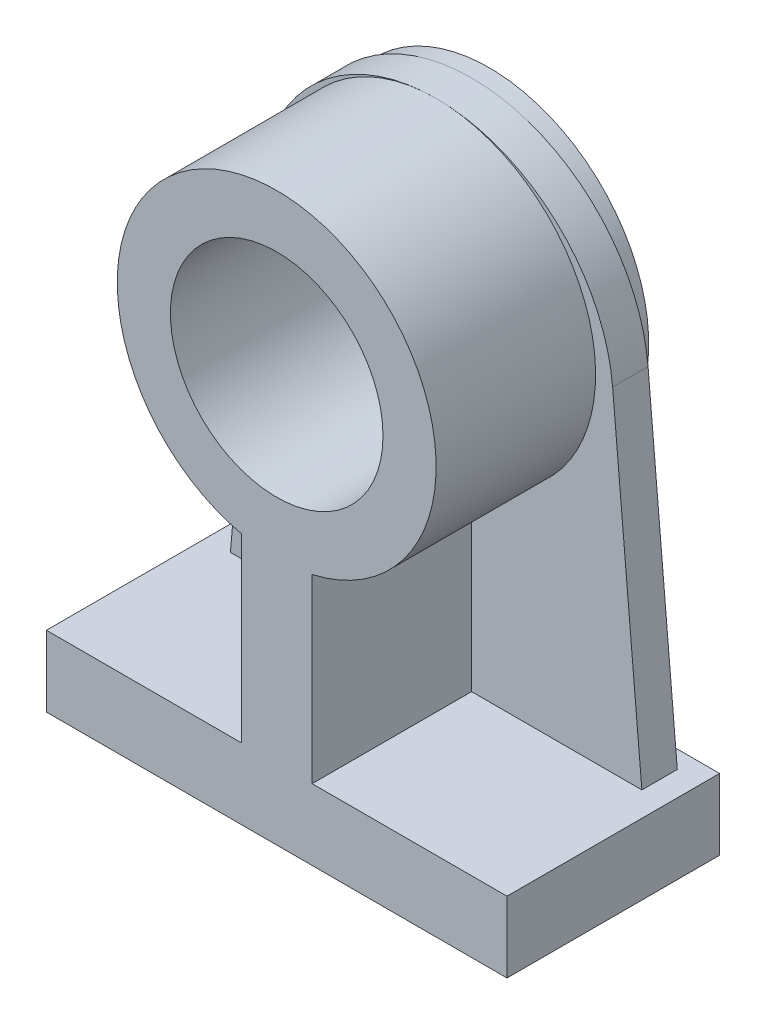
ISO-10303-21;
HEADER;
FILE_DESCRIPTION(('STEP AP214'),'2;1');
FILE_NAME('part.step','',(''),(''),'','','');
FILE_SCHEMA(('AUTOMOTIVE_DESIGN { 1 0 10303 214 1 1 1 1 }'));
ENDSEC;
DATA;
#1=APPLICATION_CONTEXT('core data for automotive mechanical design processes');
#2=APPLICATION_PROTOCOL_DEFINITION('international standard','automotive_design',2000,#1);
#3=PRODUCT_CONTEXT('',#1,'mechanical');
#4=PRODUCT('Part','Part','',(#3));
#5=PRODUCT_RELATED_PRODUCT_CATEGORY('part','',(#4));
#6=PRODUCT_DEFINITION_FORMATION('','',#4);
#7=PRODUCT_DEFINITION_CONTEXT('part definition',#1,'design');
#8=PRODUCT_DEFINITION('design','',#6,#7);
#9=PRODUCT_DEFINITION_SHAPE('','',#8);
#10=(LENGTH_UNIT() NAMED_UNIT(*) SI_UNIT(.MILLI.,.METRE.));
#11=(NAMED_UNIT(*) PLANE_ANGLE_UNIT() SI_UNIT($,.RADIAN.));
#12=(NAMED_UNIT(*) SI_UNIT($,.STERADIAN.) SOLID_ANGLE_UNIT());
#13=UNCERTAINTY_MEASURE_WITH_UNIT(LENGTH_MEASURE(1.E-05),#10,'distance_accuracy_value','');
#14=(GEOMETRIC_REPRESENTATION_CONTEXT(3) GLOBAL_UNCERTAINTY_ASSIGNED_CONTEXT((#13)) GLOBAL_UNIT_ASSIGNED_CONTEXT((#10,
#11,#12)) REPRESENTATION_CONTEXT('',''));
#15=CARTESIAN_POINT('',(0.,0.,0.));
#16=DIRECTION('',(0.,0.,1.));
#17=DIRECTION('',(1.,0.,0.));
#18=AXIS2_PLACEMENT_3D('',#15,#16,#17);
#19=CARTESIAN_POINT('',(0.,0.,2.5));
#20=DIRECTION('',(0.,0.,1.));
#21=DIRECTION('',(1.,0.,0.));
#22=AXIS2_PLACEMENT_3D('',#19,#20,#21);
#23=PLANE('',#22);
#24=DIRECTION('',(0.,-1.,0.));
#25=VECTOR('',#24,1.);
#26=CARTESIAN_POINT('',(4.99999999999999,0.,2.5));
#27=LINE('',#26,#25);
#28=CARTESIAN_POINT('',(5.,30.5625890315197,2.5));
#29=VERTEX_POINT('',#28);
#30=CARTESIAN_POINT('',(4.99999999999999,5.,2.5));
#31=VERTEX_POINT('',#30);
#32=EDGE_CURVE('E50',#29,#31,#27,.T.);
#33=ORIENTED_EDGE('',*,*,#32,.T.);
#34=DIRECTION('',(1.,0.,0.));
#35=VECTOR('',#34,1.);
#36=CARTESIAN_POINT('',(0.,5.,2.5));
#37=LINE('',#36,#35);
#38=CARTESIAN_POINT('',(29.0324857972501,5.,2.5));
#39=VERTEX_POINT('',#38);
#40=EDGE_CURVE('E242',#31,#39,#37,.T.);
#41=ORIENTED_EDGE('',*,*,#40,.T.);
#42=DIRECTION('',(-0.0871557427476544,0.996194698091746,0.));
#43=VECTOR('',#42,1.);
#44=CARTESIAN_POINT('',(29.2460718939667,2.55869974338613,2.5));
#45=LINE('',#44,#43);
#46=CARTESIAN_POINT('',(24.9048674522936,52.1788935686914,2.5));
#47=VERTEX_POINT('',#46);
#48=EDGE_CURVE('E253',#39,#47,#45,.T.);
#49=ORIENTED_EDGE('',*,*,#48,.T.);
#50=CARTESIAN_POINT('',(0.,50.,2.5));
#51=DIRECTION('',(0.,0.,1.));
#52=DIRECTION('',(1.,0.,0.));
#53=AXIS2_PLACEMENT_3D('',#50,#51,#52);
#54=CIRCLE('',#53,25.);
#55=CARTESIAN_POINT('',(0.,75.,2.5));
#56=VERTEX_POINT('',#55);
#57=EDGE_CURVE('E250',#56,#47,#54,.F.);
#58=ORIENTED_EDGE('',*,*,#57,.F.);
#59=CARTESIAN_POINT('',(0.,52.5,2.5));
#60=DIRECTION('',(0.,0.,1.));
#61=DIRECTION('',(1.,0.,0.));
#62=AXIS2_PLACEMENT_3D('',#59,#60,#61);
#63=CIRCLE('',#62,22.5);
#64=EDGE_CURVE('E238',#29,#56,#63,.T.);
#65=ORIENTED_EDGE('',*,*,#64,.F.);
#66=EDGE_LOOP('',(#33,#41,#49,#58,#65));
#67=FACE_BOUND('',#66,.T.);
#68=ADVANCED_FACE('F35',(#67),#23,.T.);
#69=DIRECTION('',(0.0871557427476544,0.996194698091746,0.));
#70=VECTOR('',#69,1.);
#71=CARTESIAN_POINT('',(-29.2460718939667,2.55869974338613,2.5));
#72=LINE('',#71,#70);
#73=CARTESIAN_POINT('',(-29.0324857972501,5.,2.5));
#74=VERTEX_POINT('',#73);
#75=CARTESIAN_POINT('',(-24.9048674522936,52.1788935686914,2.5));
#76=VERTEX_POINT('',#75);
#77=EDGE_CURVE('E249',#74,#76,#72,.T.);
#78=ORIENTED_EDGE('',*,*,#77,.F.);
#79=DIRECTION('',(1.,0.,0.));
#80=VECTOR('',#79,1.);
#81=CARTESIAN_POINT('',(0.,5.,2.5));
#82=LINE('',#81,#80);
#83=CARTESIAN_POINT('',(-4.99999999999999,5.,2.5));
#84=VERTEX_POINT('',#83);
#85=EDGE_CURVE('E58',#74,#84,#82,.T.);
#86=ORIENTED_EDGE('',*,*,#85,.T.);
#87=DIRECTION('',(0.,-1.,0.));
#88=VECTOR('',#87,1.);
#89=CARTESIAN_POINT('',(-4.99999999999999,0.,2.5));
#90=LINE('',#89,#88);
#91=CARTESIAN_POINT('',(-5.,30.5625890315197,2.5));
#92=VERTEX_POINT('',#91);
#93=EDGE_CURVE('E239',#92,#84,#90,.T.);
#94=ORIENTED_EDGE('',*,*,#93,.F.);
#95=EDGE_CURVE('E228',#56,#92,#63,.T.);
#96=ORIENTED_EDGE('',*,*,#95,.F.);
#97=EDGE_CURVE('E246',#76,#56,#54,.F.);
#98=ORIENTED_EDGE('',*,*,#97,.F.);
#99=EDGE_LOOP('',(#78,#86,#94,#96,#98));
#100=FACE_BOUND('',#99,.T.);
#101=ADVANCED_FACE('F344',(#100),#23,.T.);
#102=CARTESIAN_POINT('',(0.,0.,-2.5));
#103=DIRECTION('',(0.,0.,1.));
#104=DIRECTION('',(1.,0.,0.));
#105=AXIS2_PLACEMENT_3D('',#102,#103,#104);
#106=PLANE('',#105);
#107=DIRECTION('',(1.,0.,0.));
#108=VECTOR('',#107,1.);
#109=CARTESIAN_POINT('',(0.,5.,-2.5));
#110=LINE('',#109,#108);
#111=CARTESIAN_POINT('',(4.99999999999999,5.,-2.5));
#112=VERTEX_POINT('',#111);
#113=CARTESIAN_POINT('',(29.0324857972501,5.,-2.5));
#114=VERTEX_POINT('',#113);
#115=EDGE_CURVE('E11',#112,#114,#110,.T.);
#116=ORIENTED_EDGE('',*,*,#115,.F.);
#117=DIRECTION('',(0.,-1.,0.));
#118=VECTOR('',#117,1.);
#119=CARTESIAN_POINT('',(4.99999999999999,0.,-2.5));
#120=LINE('',#119,#118);
#121=CARTESIAN_POINT('',(5.,30.5625890315197,-2.5));
#122=VERTEX_POINT('',#121);
#123=EDGE_CURVE('E43',#122,#112,#120,.T.);
#124=ORIENTED_EDGE('',*,*,#123,.F.);
#125=CARTESIAN_POINT('',(0.,52.5,-2.5));
#126=DIRECTION('',(0.,0.,1.));
#127=DIRECTION('',(1.,0.,0.));
#128=AXIS2_PLACEMENT_3D('',#125,#126,#127);
#129=CIRCLE('',#128,22.5);
#130=CARTESIAN_POINT('',(0.,75.,-2.5));
#131=VERTEX_POINT('',#130);
#132=EDGE_CURVE('E287',#122,#131,#129,.T.);
#133=ORIENTED_EDGE('',*,*,#132,.T.);
#134=CARTESIAN_POINT('',(0.,50.,-2.5));
#135=DIRECTION('',(0.,0.,1.));
#136=DIRECTION('',(1.,0.,0.));
#137=AXIS2_PLACEMENT_3D('',#134,#135,#136);
#138=CIRCLE('',#137,25.);
#139=CARTESIAN_POINT('',(24.9048674522936,52.1788935686914,-2.5));
#140=VERTEX_POINT('',#139);
#141=EDGE_CURVE('E245',#131,#140,#138,.F.);
#142=ORIENTED_EDGE('',*,*,#141,.T.);
#143=DIRECTION('',(-0.0871557427476544,0.996194698091746,0.));
#144=VECTOR('',#143,1.);
#145=CARTESIAN_POINT('',(29.2460718939667,2.55869974338613,-2.5));
#146=LINE('',#145,#144);
#147=EDGE_CURVE('E263',#114,#140,#146,.T.);
#148=ORIENTED_EDGE('',*,*,#147,.F.);
#149=EDGE_LOOP('',(#116,#124,#133,#142,#148));
#150=FACE_BOUND('',#149,.T.);
#151=ADVANCED_FACE('F304',(#150),#106,.F.);
#152=DIRECTION('',(1.,0.,0.));
#153=VECTOR('',#152,1.);
#154=CARTESIAN_POINT('',(0.,5.,-2.5));
#155=LINE('',#154,#153);
#156=CARTESIAN_POINT('',(-29.0324857972501,5.,-2.5));
#157=VERTEX_POINT('',#156);
#158=CARTESIAN_POINT('',(-4.99999999999999,5.,-2.5));
#159=VERTEX_POINT('',#158);
#160=EDGE_CURVE('E291',#157,#159,#155,.T.);
#161=ORIENTED_EDGE('',*,*,#160,.F.);
#162=DIRECTION('',(0.0871557427476544,0.996194698091746,0.));
#163=VECTOR('',#162,1.);
#164=CARTESIAN_POINT('',(-29.2460718939667,2.55869974338613,-2.5));
#165=LINE('',#164,#163);
#166=CARTESIAN_POINT('',(-24.9048674522936,52.1788935686914,-2.5));
#167=VERTEX_POINT('',#166);
#168=EDGE_CURVE('E260',#157,#167,#165,.T.);
#169=ORIENTED_EDGE('',*,*,#168,.T.);
#170=EDGE_CURVE('E257',#167,#131,#138,.F.);
#171=ORIENTED_EDGE('',*,*,#170,.T.);
#172=CARTESIAN_POINT('',(-5.,30.5625890315197,-2.5));
#173=VERTEX_POINT('',#172);
#174=EDGE_CURVE('E284',#131,#173,#129,.T.);
#175=ORIENTED_EDGE('',*,*,#174,.T.);
#176=DIRECTION('',(0.,-1.,0.));
#177=VECTOR('',#176,1.);
#178=CARTESIAN_POINT('',(-4.99999999999999,0.,-2.5));
#179=LINE('',#178,#177);
#180=EDGE_CURVE('E288',#173,#159,#179,.T.);
#181=ORIENTED_EDGE('',*,*,#180,.T.);
#182=EDGE_LOOP('',(#161,#169,#171,#175,#181));
#183=FACE_BOUND('',#182,.T.);
#184=ADVANCED_FACE('F340',(#183),#106,.F.);
#185=CARTESIAN_POINT('',(0.,50.,2.5));
#186=DIRECTION('',(0.,0.,-1.));
#187=DIRECTION('',(-1.,0.,0.));
#188=AXIS2_PLACEMENT_3D('',#185,#186,#187);
#189=CYLINDRICAL_SURFACE('',#188,25.);
#190=ORIENTED_EDGE('',*,*,#97,.T.);
#191=ORIENTED_EDGE('',*,*,#57,.T.);
#192=DIRECTION('',(0.,0.,-1.));
#193=VECTOR('',#192,1.);
#194=CARTESIAN_POINT('',(24.9048674522936,52.1788935686914,2.5));
#195=LINE('',#194,#193);
#196=EDGE_CURVE('E256',#47,#140,#195,.T.);
#197=ORIENTED_EDGE('',*,*,#196,.T.);
#198=ORIENTED_EDGE('',*,*,#141,.F.);
#199=ORIENTED_EDGE('',*,*,#170,.F.);
#200=DIRECTION('',(0.,0.,-1.));
#201=VECTOR('',#200,1.);
#202=CARTESIAN_POINT('',(-24.9048674522936,52.1788935686914,2.5));
#203=LINE('',#202,#201);
#204=EDGE_CURVE('E282',#76,#167,#203,.T.);
#205=ORIENTED_EDGE('',*,*,#204,.F.);
#206=EDGE_LOOP('',(#190,#191,#197,#198,#199,#205));
#207=FACE_BOUND('',#206,.T.);
#208=ADVANCED_FACE('F37',(#207),#189,.T.);
#209=CARTESIAN_POINT('',(-29.2460718939667,2.55869974338613,2.5));
#210=DIRECTION('',(-0.996194698091746,0.0871557427476544,0.));
#211=DIRECTION('',(-0.0871557427476544,-0.996194698091746,0.));
#212=AXIS2_PLACEMENT_3D('',#209,#210,#211);
#213=PLANE('',#212);
#214=ORIENTED_EDGE('',*,*,#168,.F.);
#215=DIRECTION('',(0.,0.,-1.));
#216=VECTOR('',#215,1.);
#217=CARTESIAN_POINT('',(-29.0324857972501,5.,2.5));
#218=LINE('',#217,#216);
#219=EDGE_CURVE('E279',#74,#157,#218,.T.);
#220=ORIENTED_EDGE('',*,*,#219,.F.);
#221=ORIENTED_EDGE('',*,*,#77,.T.);
#222=ORIENTED_EDGE('',*,*,#204,.T.);
#223=EDGE_LOOP('',(#214,#220,#221,#222));
#224=FACE_BOUND('',#223,.T.);
#225=ADVANCED_FACE('F343',(#224),#213,.T.);
#226=CARTESIAN_POINT('',(0.,5.,2.5));
#227=DIRECTION('',(0.,1.,0.));
#228=DIRECTION('',(-1.,0.,0.));
#229=AXIS2_PLACEMENT_3D('',#226,#227,#228);
#230=PLANE('',#229);
#231=ORIENTED_EDGE('',*,*,#219,.T.);
#232=ORIENTED_EDGE('',*,*,#160,.T.);
#233=DIRECTION('',(0.,0.,1.));
#234=VECTOR('',#233,1.);
#235=CARTESIAN_POINT('',(-4.99999999999999,5.,-5.));
#236=LINE('',#235,#234);
#237=CARTESIAN_POINT('',(-4.99999999999999,5.,-5.));
#238=VERTEX_POINT('',#237);
#239=EDGE_CURVE('E230',#238,#159,#236,.T.);
#240=ORIENTED_EDGE('',*,*,#239,.F.);
#241=DIRECTION('',(1.,0.,0.));
#242=VECTOR('',#241,1.);
#243=CARTESIAN_POINT('',(0.,5.,-5.));
#244=LINE('',#243,#242);
#245=CARTESIAN_POINT('',(-32.5,5.,-5.));
#246=VERTEX_POINT('',#245);
#247=EDGE_CURVE('E212',#246,#238,#244,.T.);
#248=ORIENTED_EDGE('',*,*,#247,.F.);
#249=DIRECTION('',(0.,0.,-1.));
#250=VECTOR('',#249,1.);
#251=CARTESIAN_POINT('',(-32.5,5.,2.5));
#252=LINE('',#251,#250);
#253=CARTESIAN_POINT('',(-32.5,5.,25.));
#254=VERTEX_POINT('',#253);
#255=EDGE_CURVE('E277',#254,#246,#252,.T.);
#256=ORIENTED_EDGE('',*,*,#255,.F.);
#257=DIRECTION('',(1.,0.,0.));
#258=VECTOR('',#257,1.);
#259=CARTESIAN_POINT('',(0.,5.,25.));
#260=LINE('',#259,#258);
#261=CARTESIAN_POINT('',(-4.99999999999999,5.,25.));
#262=VERTEX_POINT('',#261);
#263=EDGE_CURVE('E187',#254,#262,#260,.T.);
#264=ORIENTED_EDGE('',*,*,#263,.T.);
#265=EDGE_CURVE('E233',#84,#262,#236,.T.);
#266=ORIENTED_EDGE('',*,*,#265,.F.);
#267=ORIENTED_EDGE('',*,*,#85,.F.);
#268=EDGE_LOOP('',(#231,#232,#240,#248,#256,#264,#266,#267));
#269=FACE_BOUND('',#268,.T.);
#270=ADVANCED_FACE('F319',(#269),#230,.T.);
#271=CARTESIAN_POINT('',(-32.5,0.,2.5));
#272=DIRECTION('',(1.,0.,0.));
#273=DIRECTION('',(0.,0.,-1.));
#274=AXIS2_PLACEMENT_3D('',#271,#272,#273);
#275=PLANE('',#274);
#276=ORIENTED_EDGE('',*,*,#255,.T.);
#277=DIRECTION('',(0.,-1.,0.));
#278=VECTOR('',#277,1.);
#279=CARTESIAN_POINT('',(-32.5,0.,-5.));
#280=LINE('',#279,#278);
#281=CARTESIAN_POINT('',(-32.5,-5.,-5.));
#282=VERTEX_POINT('',#281);
#283=EDGE_CURVE('E214',#246,#282,#280,.T.);
#284=ORIENTED_EDGE('',*,*,#283,.T.);
#285=DIRECTION('',(0.,0.,-1.));
#286=VECTOR('',#285,1.);
#287=CARTESIAN_POINT('',(-32.5,-5.,2.5));
#288=LINE('',#287,#286);
#289=CARTESIAN_POINT('',(-32.5,-5.,25.));
#290=VERTEX_POINT('',#289);
#291=EDGE_CURVE('E275',#290,#282,#288,.T.);
#292=ORIENTED_EDGE('',*,*,#291,.F.);
#293=DIRECTION('',(0.,-1.,0.));
#294=VECTOR('',#293,1.);
#295=CARTESIAN_POINT('',(-32.5,0.,25.));
#296=LINE('',#295,#294);
#297=EDGE_CURVE('E190',#254,#290,#296,.T.);
#298=ORIENTED_EDGE('',*,*,#297,.F.);
#299=EDGE_LOOP('',(#276,#284,#292,#298));
#300=FACE_BOUND('',#299,.T.);
#301=ADVANCED_FACE('F325',(#300),#275,.F.);
#302=CARTESIAN_POINT('',(0.,-5.,2.5));
#303=DIRECTION('',(0.,1.,0.));
#304=DIRECTION('',(0.,0.,1.));
#305=AXIS2_PLACEMENT_3D('',#302,#303,#304);
#306=PLANE('',#305);
#307=ORIENTED_EDGE('',*,*,#291,.T.);
#308=DIRECTION('',(1.,0.,0.));
#309=VECTOR('',#308,1.);
#310=CARTESIAN_POINT('',(0.,-5.,-5.));
#311=LINE('',#310,#309);
#312=CARTESIAN_POINT('',(32.5,-5.,-5.));
#313=VERTEX_POINT('',#312);
#314=EDGE_CURVE('E217',#282,#313,#311,.T.);
#315=ORIENTED_EDGE('',*,*,#314,.T.);
#316=DIRECTION('',(0.,0.,-1.));
#317=VECTOR('',#316,1.);
#318=CARTESIAN_POINT('',(32.5,-5.,2.5));
#319=LINE('',#318,#317);
#320=CARTESIAN_POINT('',(32.5,-5.,25.));
#321=VERTEX_POINT('',#320);
#322=EDGE_CURVE('E273',#321,#313,#319,.T.);
#323=ORIENTED_EDGE('',*,*,#322,.F.);
#324=DIRECTION('',(1.,0.,0.));
#325=VECTOR('',#324,1.);
#326=CARTESIAN_POINT('',(0.,-5.,25.));
#327=LINE('',#326,#325);
#328=EDGE_CURVE('E193',#290,#321,#327,.T.);
#329=ORIENTED_EDGE('',*,*,#328,.F.);
#330=EDGE_LOOP('',(#307,#315,#323,#329));
#331=FACE_BOUND('',#330,.T.);
#332=ADVANCED_FACE('F375',(#331),#306,.F.);
#333=CARTESIAN_POINT('',(32.5,0.,2.5));
#334=DIRECTION('',(1.,0.,0.));
#335=DIRECTION('',(0.,0.,-1.));
#336=AXIS2_PLACEMENT_3D('',#333,#334,#335);
#337=PLANE('',#336);
#338=ORIENTED_EDGE('',*,*,#322,.T.);
#339=DIRECTION('',(0.,-1.,0.));
#340=VECTOR('',#339,1.);
#341=CARTESIAN_POINT('',(32.5,0.,-5.));
#342=LINE('',#341,#340);
#343=CARTESIAN_POINT('',(32.5,5.,-5.));
#344=VERTEX_POINT('',#343);
#345=EDGE_CURVE('E220',#344,#313,#342,.T.);
#346=ORIENTED_EDGE('',*,*,#345,.F.);
#347=DIRECTION('',(0.,0.,-1.));
#348=VECTOR('',#347,1.);
#349=CARTESIAN_POINT('',(32.5,5.,2.5));
#350=LINE('',#349,#348);
#351=CARTESIAN_POINT('',(32.5,5.,25.));
#352=VERTEX_POINT('',#351);
#353=EDGE_CURVE('E271',#352,#344,#350,.T.);
#354=ORIENTED_EDGE('',*,*,#353,.F.);
#355=DIRECTION('',(0.,-1.,0.));
#356=VECTOR('',#355,1.);
#357=CARTESIAN_POINT('',(32.5,0.,25.));
#358=LINE('',#357,#356);
#359=EDGE_CURVE('E196',#352,#321,#358,.T.);
#360=ORIENTED_EDGE('',*,*,#359,.T.);
#361=EDGE_LOOP('',(#338,#346,#354,#360));
#362=FACE_BOUND('',#361,.T.);
#363=ADVANCED_FACE('F329',(#362),#337,.T.);
#364=CARTESIAN_POINT('',(0.,5.,2.5));
#365=DIRECTION('',(0.,1.,0.));
#366=DIRECTION('',(-1.,0.,0.));
#367=AXIS2_PLACEMENT_3D('',#364,#365,#366);
#368=PLANE('',#367);
#369=ORIENTED_EDGE('',*,*,#353,.T.);
#370=DIRECTION('',(1.,0.,0.));
#371=VECTOR('',#370,1.);
#372=CARTESIAN_POINT('',(0.,5.,-5.));
#373=LINE('',#372,#371);
#374=CARTESIAN_POINT('',(4.99999999999999,5.,-5.));
#375=VERTEX_POINT('',#374);
#376=EDGE_CURVE('E164',#375,#344,#373,.T.);
#377=ORIENTED_EDGE('',*,*,#376,.F.);
#378=DIRECTION('',(0.,0.,1.));
#379=VECTOR('',#378,1.);
#380=CARTESIAN_POINT('',(4.99999999999999,5.,-5.));
#381=LINE('',#380,#379);
#382=EDGE_CURVE('E225',#375,#112,#381,.T.);
#383=ORIENTED_EDGE('',*,*,#382,.T.);
#384=ORIENTED_EDGE('',*,*,#115,.T.);
#385=DIRECTION('',(0.,0.,-1.));
#386=VECTOR('',#385,1.);
#387=CARTESIAN_POINT('',(29.0324857972501,5.,2.5));
#388=LINE('',#387,#386);
#389=EDGE_CURVE('E268',#39,#114,#388,.T.);
#390=ORIENTED_EDGE('',*,*,#389,.F.);
#391=ORIENTED_EDGE('',*,*,#40,.F.);
#392=CARTESIAN_POINT('',(4.99999999999999,5.,25.));
#393=VERTEX_POINT('',#392);
#394=EDGE_CURVE('E229',#31,#393,#381,.T.);
#395=ORIENTED_EDGE('',*,*,#394,.T.);
#396=DIRECTION('',(1.,0.,0.));
#397=VECTOR('',#396,1.);
#398=CARTESIAN_POINT('',(0.,5.,25.));
#399=LINE('',#398,#397);
#400=EDGE_CURVE('E180',#393,#352,#399,.T.);
#401=ORIENTED_EDGE('',*,*,#400,.T.);
#402=EDGE_LOOP('',(#369,#377,#383,#384,#390,#391,#395,#401));
#403=FACE_BOUND('',#402,.T.);
#404=ADVANCED_FACE('F301',(#403),#368,.T.);
#405=CARTESIAN_POINT('',(29.2460718939667,2.55869974338613,2.5));
#406=DIRECTION('',(-0.996194698091746,-0.0871557427476544,0.));
#407=DIRECTION('',(0.0871557427476544,-0.996194698091746,0.));
#408=AXIS2_PLACEMENT_3D('',#405,#406,#407);
#409=PLANE('',#408);
#410=ORIENTED_EDGE('',*,*,#147,.T.);
#411=ORIENTED_EDGE('',*,*,#196,.F.);
#412=ORIENTED_EDGE('',*,*,#48,.F.);
#413=ORIENTED_EDGE('',*,*,#389,.T.);
#414=EDGE_LOOP('',(#410,#411,#412,#413));
#415=FACE_BOUND('',#414,.T.);
#416=ADVANCED_FACE('F308',(#415),#409,.F.);
#417=CARTESIAN_POINT('',(0.,0.,-5.));
#418=DIRECTION('',(0.,0.,1.));
#419=DIRECTION('',(1.,0.,0.));
#420=AXIS2_PLACEMENT_3D('',#417,#418,#419);
#421=PLANE('',#420);
#422=CARTESIAN_POINT('',(0.,52.5,-5.));
#423=DIRECTION('',(0.,0.,1.));
#424=DIRECTION('',(1.,0.,0.));
#425=AXIS2_PLACEMENT_3D('',#422,#423,#424);
#426=CIRCLE('',#425,15.);
#427=CARTESIAN_POINT('',(15.,52.5,-5.));
#428=VERTEX_POINT('',#427);
#429=EDGE_CURVE('E200',#428,#428,#426,.T.);
#430=ORIENTED_EDGE('',*,*,#429,.T.);
#431=EDGE_LOOP('',(#430));
#432=FACE_BOUND('',#431,.T.);
#433=DIRECTION('',(0.,-1.,0.));
#434=VECTOR('',#433,1.);
#435=CARTESIAN_POINT('',(4.99999999999999,0.,-5.));
#436=LINE('',#435,#434);
#437=CARTESIAN_POINT('',(5.,30.5625890315197,-5.));
#438=VERTEX_POINT('',#437);
#439=EDGE_CURVE('E203',#438,#375,#436,.T.);
#440=ORIENTED_EDGE('',*,*,#439,.T.);
#441=ORIENTED_EDGE('',*,*,#376,.T.);
#442=ORIENTED_EDGE('',*,*,#345,.T.);
#443=ORIENTED_EDGE('',*,*,#314,.F.);
#444=ORIENTED_EDGE('',*,*,#283,.F.);
#445=ORIENTED_EDGE('',*,*,#247,.T.);
#446=DIRECTION('',(0.,-1.,0.));
#447=VECTOR('',#446,1.);
#448=CARTESIAN_POINT('',(-4.99999999999999,0.,-5.));
#449=LINE('',#448,#447);
#450=CARTESIAN_POINT('',(-5.,30.5625890315197,-5.));
#451=VERTEX_POINT('',#450);
#452=EDGE_CURVE('E209',#451,#238,#449,.T.);
#453=ORIENTED_EDGE('',*,*,#452,.F.);
#454=CARTESIAN_POINT('',(0.,52.5,-5.));
#455=DIRECTION('',(0.,0.,1.));
#456=DIRECTION('',(1.,0.,0.));
#457=AXIS2_PLACEMENT_3D('',#454,#455,#456);
#458=CIRCLE('',#457,22.5);
#459=EDGE_CURVE('E206',#438,#451,#458,.T.);
#460=ORIENTED_EDGE('',*,*,#459,.F.);
#461=EDGE_LOOP('',(#440,#441,#442,#443,#444,#445,#453,#460));
#462=FACE_BOUND('',#461,.T.);
#463=ADVANCED_FACE('F332',(#432,#462),#421,.F.);
#464=CARTESIAN_POINT('',(0.,52.5,-5.));
#465=DIRECTION('',(0.,0.,1.));
#466=DIRECTION('',(1.,0.,0.));
#467=AXIS2_PLACEMENT_3D('',#464,#465,#466);
#468=CYLINDRICAL_SURFACE('',#467,22.5);
#469=ORIENTED_EDGE('',*,*,#132,.F.);
#470=DIRECTION('',(0.,0.,1.));
#471=VECTOR('',#470,1.);
#472=CARTESIAN_POINT('',(5.,30.5625890315197,-5.));
#473=LINE('',#472,#471);
#474=EDGE_CURVE('E163',#438,#122,#473,.T.);
#475=ORIENTED_EDGE('',*,*,#474,.F.);
#476=ORIENTED_EDGE('',*,*,#459,.T.);
#477=DIRECTION('',(0.,0.,1.));
#478=VECTOR('',#477,1.);
#479=CARTESIAN_POINT('',(-5.,30.5625890315197,-5.));
#480=LINE('',#479,#478);
#481=EDGE_CURVE('E234',#451,#173,#480,.T.);
#482=ORIENTED_EDGE('',*,*,#481,.T.);
#483=ORIENTED_EDGE('',*,*,#174,.F.);
#484=EDGE_LOOP('',(#469,#475,#476,#482,#483));
#485=FACE_BOUND('',#484,.T.);
#486=ADVANCED_FACE('F337',(#485),#468,.T.);
#487=CARTESIAN_POINT('',(-4.99999999999999,0.,-5.));
#488=DIRECTION('',(-1.,0.,0.));
#489=DIRECTION('',(0.,-1.,0.));
#490=AXIS2_PLACEMENT_3D('',#487,#488,#489);
#491=PLANE('',#490);
#492=ORIENTED_EDGE('',*,*,#180,.F.);
#493=ORIENTED_EDGE('',*,*,#481,.F.);
#494=ORIENTED_EDGE('',*,*,#452,.T.);
#495=ORIENTED_EDGE('',*,*,#239,.T.);
#496=EDGE_LOOP('',(#492,#493,#494,#495));
#497=FACE_BOUND('',#496,.T.);
#498=ADVANCED_FACE('F346',(#497),#491,.T.);
#499=CARTESIAN_POINT('',(4.99999999999999,0.,-5.));
#500=DIRECTION('',(-1.,0.,0.));
#501=DIRECTION('',(0.,-1.,0.));
#502=AXIS2_PLACEMENT_3D('',#499,#500,#501);
#503=PLANE('',#502);
#504=ORIENTED_EDGE('',*,*,#474,.T.);
#505=ORIENTED_EDGE('',*,*,#123,.T.);
#506=ORIENTED_EDGE('',*,*,#382,.F.);
#507=ORIENTED_EDGE('',*,*,#439,.F.);
#508=EDGE_LOOP('',(#504,#505,#506,#507));
#509=FACE_BOUND('',#508,.T.);
#510=ADVANCED_FACE('F295',(#509),#503,.F.);
#511=CARTESIAN_POINT('',(0.,52.5,2.5));
#512=DIRECTION('',(0.,0.,-1.));
#513=DIRECTION('',(-1.,0.,0.));
#514=AXIS2_PLACEMENT_3D('',#511,#512,#513);
#515=CYLINDRICAL_SURFACE('',#514,15.);
#516=ORIENTED_EDGE('',*,*,#429,.F.);
#517=EDGE_LOOP('',(#516));
#518=FACE_BOUND('',#517,.T.);
#519=CARTESIAN_POINT('',(0.,52.5,25.));
#520=DIRECTION('',(0.,0.,1.));
#521=DIRECTION('',(1.,0.,0.));
#522=AXIS2_PLACEMENT_3D('',#519,#520,#521);
#523=CIRCLE('',#522,15.);
#524=CARTESIAN_POINT('',(15.,52.5,25.));
#525=VERTEX_POINT('',#524);
#526=EDGE_CURVE('E181',#525,#525,#523,.T.);
#527=ORIENTED_EDGE('',*,*,#526,.T.);
#528=EDGE_LOOP('',(#527));
#529=FACE_BOUND('',#528,.T.);
#530=ADVANCED_FACE('F353',(#518,#529),#515,.F.);
#531=ORIENTED_EDGE('',*,*,#32,.F.);
#532=CARTESIAN_POINT('',(5.,30.5625890315197,25.));
#533=VERTEX_POINT('',#532);
#534=EDGE_CURVE('E154',#29,#533,#473,.T.);
#535=ORIENTED_EDGE('',*,*,#534,.T.);
#536=DIRECTION('',(0.,-1.,0.));
#537=VECTOR('',#536,1.);
#538=CARTESIAN_POINT('',(4.99999999999999,0.,25.));
#539=LINE('',#538,#537);
#540=EDGE_CURVE('E159',#533,#393,#539,.T.);
#541=ORIENTED_EDGE('',*,*,#540,.T.);
#542=ORIENTED_EDGE('',*,*,#394,.F.);
#543=EDGE_LOOP('',(#531,#535,#541,#542));
#544=FACE_BOUND('',#543,.T.);
#545=ADVANCED_FACE('F156',(#544),#503,.F.);
#546=CARTESIAN_POINT('',(-5.,30.5625890315197,25.));
#547=VERTEX_POINT('',#546);
#548=EDGE_CURVE('E171',#92,#547,#480,.T.);
#549=ORIENTED_EDGE('',*,*,#548,.F.);
#550=ORIENTED_EDGE('',*,*,#93,.T.);
#551=ORIENTED_EDGE('',*,*,#265,.T.);
#552=DIRECTION('',(0.,-1.,0.));
#553=VECTOR('',#552,1.);
#554=CARTESIAN_POINT('',(-4.99999999999999,0.,25.));
#555=LINE('',#554,#553);
#556=EDGE_CURVE('E175',#547,#262,#555,.T.);
#557=ORIENTED_EDGE('',*,*,#556,.F.);
#558=EDGE_LOOP('',(#549,#550,#551,#557));
#559=FACE_BOUND('',#558,.T.);
#560=ADVANCED_FACE('F315',(#559),#491,.T.);
#561=ORIENTED_EDGE('',*,*,#534,.F.);
#562=ORIENTED_EDGE('',*,*,#64,.T.);
#563=ORIENTED_EDGE('',*,*,#95,.T.);
#564=ORIENTED_EDGE('',*,*,#548,.T.);
#565=CARTESIAN_POINT('',(0.,52.5,25.));
#566=DIRECTION('',(0.,0.,1.));
#567=DIRECTION('',(1.,0.,0.));
#568=AXIS2_PLACEMENT_3D('',#565,#566,#567);
#569=CIRCLE('',#568,22.5);
#570=EDGE_CURVE('E167',#533,#547,#569,.T.);
#571=ORIENTED_EDGE('',*,*,#570,.F.);
#572=EDGE_LOOP('',(#561,#562,#563,#564,#571));
#573=FACE_BOUND('',#572,.T.);
#574=ADVANCED_FACE('F168',(#573),#468,.T.);
#575=CARTESIAN_POINT('',(0.,0.,25.));
#576=DIRECTION('',(0.,0.,1.));
#577=DIRECTION('',(1.,0.,0.));
#578=AXIS2_PLACEMENT_3D('',#575,#576,#577);
#579=PLANE('',#578);
#580=ORIENTED_EDGE('',*,*,#526,.F.);
#581=EDGE_LOOP('',(#580));
#582=FACE_BOUND('',#581,.T.);
#583=ORIENTED_EDGE('',*,*,#540,.F.);
#584=ORIENTED_EDGE('',*,*,#570,.T.);
#585=ORIENTED_EDGE('',*,*,#556,.T.);
#586=ORIENTED_EDGE('',*,*,#263,.F.);
#587=ORIENTED_EDGE('',*,*,#297,.T.);
#588=ORIENTED_EDGE('',*,*,#328,.T.);
#589=ORIENTED_EDGE('',*,*,#359,.F.);
#590=ORIENTED_EDGE('',*,*,#400,.F.);
#591=EDGE_LOOP('',(#583,#584,#585,#586,#587,#588,#589,#590));
#592=FACE_BOUND('',#591,.T.);
#593=ADVANCED_FACE('F177',(#582,#592),#579,.T.);
#594=CLOSED_SHELL('',(#68,#101,#151,#184,#208,#225,#270,#301,#332,#363,#404,#416,#463,#486,#498,
#510,#530,#545,#560,#574,#593));
#595=MANIFOLD_SOLID_BREP('B2',#594);
#596=ADVANCED_BREP_SHAPE_REPRESENTATION('',(#18,#595),#14);
#597=SHAPE_DEFINITION_REPRESENTATION(#9,#596);
ENDSEC;
END-ISO-10303-21;
